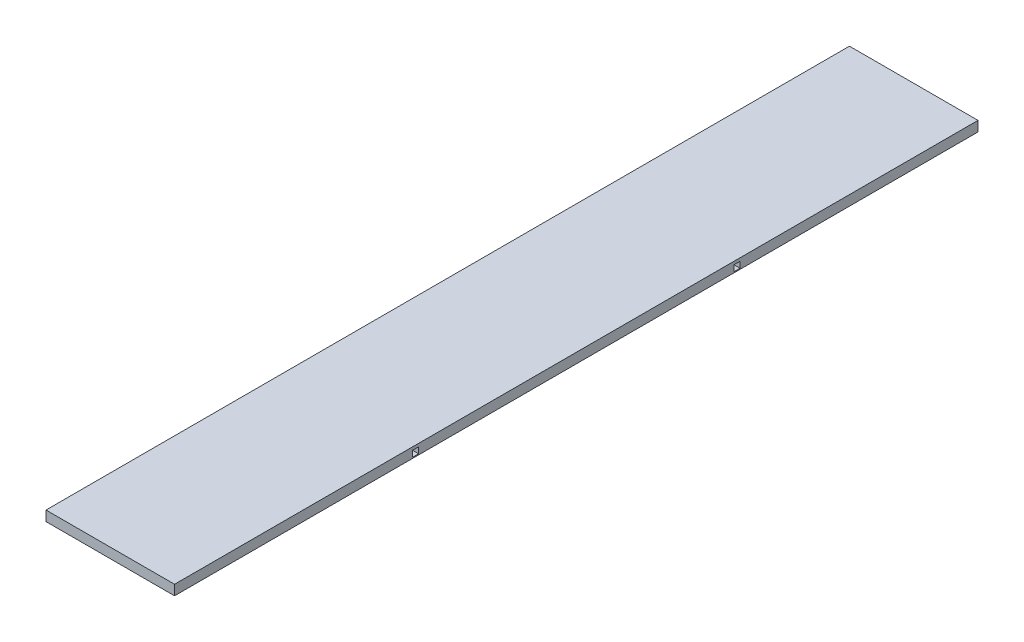
ISO-10303-21;
HEADER;
FILE_DESCRIPTION(('STEP AP214'),'2;1');
FILE_NAME('part.step','',(''),(''),'','','');
FILE_SCHEMA(('AUTOMOTIVE_DESIGN { 1 0 10303 214 1 1 1 1 }'));
ENDSEC;
DATA;
#1=APPLICATION_CONTEXT('core data for automotive mechanical design processes');
#2=APPLICATION_PROTOCOL_DEFINITION('international standard','automotive_design',2000,#1);
#3=PRODUCT_CONTEXT('',#1,'mechanical');
#4=PRODUCT('Part','Part','',(#3));
#5=PRODUCT_RELATED_PRODUCT_CATEGORY('part','',(#4));
#6=PRODUCT_DEFINITION_FORMATION('','',#4);
#7=PRODUCT_DEFINITION_CONTEXT('part definition',#1,'design');
#8=PRODUCT_DEFINITION('design','',#6,#7);
#9=PRODUCT_DEFINITION_SHAPE('','',#8);
#10=(LENGTH_UNIT() NAMED_UNIT(*) SI_UNIT(.MILLI.,.METRE.));
#11=(NAMED_UNIT(*) PLANE_ANGLE_UNIT() SI_UNIT($,.RADIAN.));
#12=(NAMED_UNIT(*) SI_UNIT($,.STERADIAN.) SOLID_ANGLE_UNIT());
#13=UNCERTAINTY_MEASURE_WITH_UNIT(LENGTH_MEASURE(1.E-05),#10,'distance_accuracy_value','');
#14=(GEOMETRIC_REPRESENTATION_CONTEXT(3) GLOBAL_UNCERTAINTY_ASSIGNED_CONTEXT((#13)) GLOBAL_UNIT_ASSIGNED_CONTEXT((#10,
#11,#12)) REPRESENTATION_CONTEXT('',''));
#15=CARTESIAN_POINT('',(0.,0.,0.));
#16=DIRECTION('',(0.,0.,1.));
#17=DIRECTION('',(1.,0.,0.));
#18=AXIS2_PLACEMENT_3D('',#15,#16,#17);
#19=CARTESIAN_POINT('',(203.2,31.75,-1270.));
#20=DIRECTION('',(-1.,0.,0.));
#21=DIRECTION('',(0.,0.,1.));
#22=AXIS2_PLACEMENT_3D('',#19,#20,#21);
#23=PLANE('',#22);
#24=DIRECTION('',(0.,0.,1.));
#25=VECTOR('',#24,1.);
#26=CARTESIAN_POINT('',(203.2,22.225,517.525));
#27=LINE('',#26,#25);
#28=CARTESIAN_POINT('',(203.2,22.225,498.475));
#29=VERTEX_POINT('',#28);
#30=CARTESIAN_POINT('',(203.2,22.225,517.525));
#31=VERTEX_POINT('',#30);
#32=EDGE_CURVE('E143',#29,#31,#27,.T.);
#33=ORIENTED_EDGE('',*,*,#32,.F.);
#34=DIRECTION('',(0.,1.,0.));
#35=VECTOR('',#34,1.);
#36=CARTESIAN_POINT('',(203.2,22.225,498.475));
#37=LINE('',#36,#35);
#38=CARTESIAN_POINT('',(203.2,3.175,498.475));
#39=VERTEX_POINT('',#38);
#40=EDGE_CURVE('E52',#39,#29,#37,.T.);
#41=ORIENTED_EDGE('',*,*,#40,.F.);
#42=DIRECTION('',(0.,0.,-1.));
#43=VECTOR('',#42,1.);
#44=CARTESIAN_POINT('',(203.2,3.175,517.525));
#45=LINE('',#44,#43);
#46=CARTESIAN_POINT('',(203.2,3.175,517.525));
#47=VERTEX_POINT('',#46);
#48=EDGE_CURVE('E149',#47,#39,#45,.T.);
#49=ORIENTED_EDGE('',*,*,#48,.F.);
#50=DIRECTION('',(0.,-1.,0.));
#51=VECTOR('',#50,1.);
#52=CARTESIAN_POINT('',(203.2,22.225,517.525));
#53=LINE('',#52,#51);
#54=EDGE_CURVE('E133',#31,#47,#53,.T.);
#55=ORIENTED_EDGE('',*,*,#54,.F.);
#56=EDGE_LOOP('',(#33,#41,#49,#55));
#57=FACE_BOUND('',#56,.T.);
#58=DIRECTION('',(0.,0.,1.));
#59=VECTOR('',#58,1.);
#60=CARTESIAN_POINT('',(203.2,22.225,-498.475));
#61=LINE('',#60,#59);
#62=CARTESIAN_POINT('',(203.2,22.225,-517.525));
#63=VERTEX_POINT('',#62);
#64=CARTESIAN_POINT('',(203.2,22.225,-498.475));
#65=VERTEX_POINT('',#64);
#66=EDGE_CURVE('E172',#63,#65,#61,.T.);
#67=ORIENTED_EDGE('',*,*,#66,.F.);
#68=DIRECTION('',(0.,1.,0.));
#69=VECTOR('',#68,1.);
#70=CARTESIAN_POINT('',(203.2,22.225,-517.525));
#71=LINE('',#70,#69);
#72=CARTESIAN_POINT('',(203.2,3.175,-517.525));
#73=VERTEX_POINT('',#72);
#74=EDGE_CURVE('E60',#73,#63,#71,.T.);
#75=ORIENTED_EDGE('',*,*,#74,.F.);
#76=DIRECTION('',(0.,0.,-1.));
#77=VECTOR('',#76,1.);
#78=CARTESIAN_POINT('',(203.2,3.175,-498.475));
#79=LINE('',#78,#77);
#80=CARTESIAN_POINT('',(203.2,3.175,-498.475));
#81=VERTEX_POINT('',#80);
#82=EDGE_CURVE('E178',#81,#73,#79,.T.);
#83=ORIENTED_EDGE('',*,*,#82,.F.);
#84=DIRECTION('',(0.,-1.,0.));
#85=VECTOR('',#84,1.);
#86=CARTESIAN_POINT('',(203.2,22.225,-498.475));
#87=LINE('',#86,#85);
#88=EDGE_CURVE('E175',#65,#81,#87,.T.);
#89=ORIENTED_EDGE('',*,*,#88,.F.);
#90=EDGE_LOOP('',(#67,#75,#83,#89));
#91=FACE_BOUND('',#90,.T.);
#92=DIRECTION('',(0.,0.,-1.));
#93=VECTOR('',#92,1.);
#94=CARTESIAN_POINT('',(203.2,0.,-1270.));
#95=LINE('',#94,#93);
#96=CARTESIAN_POINT('',(203.2,0.,1270.));
#97=VERTEX_POINT('',#96);
#98=CARTESIAN_POINT('',(203.2,0.,-1270.));
#99=VERTEX_POINT('',#98);
#100=EDGE_CURVE('E160',#97,#99,#95,.T.);
#101=ORIENTED_EDGE('',*,*,#100,.T.);
#102=DIRECTION('',(0.,-1.,0.));
#103=VECTOR('',#102,1.);
#104=CARTESIAN_POINT('',(203.2,31.75,-1270.));
#105=LINE('',#104,#103);
#106=CARTESIAN_POINT('',(203.2,31.75,-1270.));
#107=VERTEX_POINT('',#106);
#108=EDGE_CURVE('E11',#107,#99,#105,.T.);
#109=ORIENTED_EDGE('',*,*,#108,.F.);
#110=DIRECTION('',(0.,0.,-1.));
#111=VECTOR('',#110,1.);
#112=CARTESIAN_POINT('',(203.2,31.75,-1270.));
#113=LINE('',#112,#111);
#114=CARTESIAN_POINT('',(203.2,31.75,1270.));
#115=VERTEX_POINT('',#114);
#116=EDGE_CURVE('E189',#115,#107,#113,.T.);
#117=ORIENTED_EDGE('',*,*,#116,.F.);
#118=DIRECTION('',(0.,-1.,0.));
#119=VECTOR('',#118,1.);
#120=CARTESIAN_POINT('',(203.2,31.75,1270.));
#121=LINE('',#120,#119);
#122=EDGE_CURVE('E199',#115,#97,#121,.T.);
#123=ORIENTED_EDGE('',*,*,#122,.T.);
#124=EDGE_LOOP('',(#101,#109,#117,#123));
#125=FACE_BOUND('',#124,.T.);
#126=ADVANCED_FACE('F38',(#57,#91,#125),#23,.F.);
#127=CARTESIAN_POINT('',(-203.2,31.75,-1270.));
#128=DIRECTION('',(0.,0.,1.));
#129=DIRECTION('',(1.,0.,0.));
#130=AXIS2_PLACEMENT_3D('',#127,#128,#129);
#131=PLANE('',#130);
#132=DIRECTION('',(-1.,0.,0.));
#133=VECTOR('',#132,1.);
#134=CARTESIAN_POINT('',(-203.2,0.,-1270.));
#135=LINE('',#134,#133);
#136=CARTESIAN_POINT('',(-203.2,0.,-1270.));
#137=VERTEX_POINT('',#136);
#138=EDGE_CURVE('E202',#99,#137,#135,.T.);
#139=ORIENTED_EDGE('',*,*,#138,.T.);
#140=DIRECTION('',(0.,-1.,0.));
#141=VECTOR('',#140,1.);
#142=CARTESIAN_POINT('',(-203.2,31.75,-1270.));
#143=LINE('',#142,#141);
#144=CARTESIAN_POINT('',(-203.2,31.75,-1270.));
#145=VERTEX_POINT('',#144);
#146=EDGE_CURVE('E45',#145,#137,#143,.T.);
#147=ORIENTED_EDGE('',*,*,#146,.F.);
#148=DIRECTION('',(-1.,0.,0.));
#149=VECTOR('',#148,1.);
#150=CARTESIAN_POINT('',(-203.2,31.75,-1270.));
#151=LINE('',#150,#149);
#152=EDGE_CURVE('E192',#107,#145,#151,.T.);
#153=ORIENTED_EDGE('',*,*,#152,.F.);
#154=ORIENTED_EDGE('',*,*,#108,.T.);
#155=EDGE_LOOP('',(#139,#147,#153,#154));
#156=FACE_BOUND('',#155,.T.);
#157=ADVANCED_FACE('F232',(#156),#131,.F.);
#158=CARTESIAN_POINT('',(-203.2,31.75,-1270.));
#159=DIRECTION('',(1.,0.,0.));
#160=DIRECTION('',(0.,0.,-1.));
#161=AXIS2_PLACEMENT_3D('',#158,#159,#160);
#162=PLANE('',#161);
#163=DIRECTION('',(0.,0.,1.));
#164=VECTOR('',#163,1.);
#165=CARTESIAN_POINT('',(-203.2,3.175,517.525));
#166=LINE('',#165,#164);
#167=CARTESIAN_POINT('',(-203.2,3.175,498.475));
#168=VERTEX_POINT('',#167);
#169=CARTESIAN_POINT('',(-203.2,3.175,517.525));
#170=VERTEX_POINT('',#169);
#171=EDGE_CURVE('E276',#168,#170,#166,.T.);
#172=ORIENTED_EDGE('',*,*,#171,.F.);
#173=DIRECTION('',(0.,-1.,0.));
#174=VECTOR('',#173,1.);
#175=CARTESIAN_POINT('',(-203.2,22.225,498.475));
#176=LINE('',#175,#174);
#177=CARTESIAN_POINT('',(-203.2,22.225,498.475));
#178=VERTEX_POINT('',#177);
#179=EDGE_CURVE('E161',#178,#168,#176,.T.);
#180=ORIENTED_EDGE('',*,*,#179,.F.);
#181=DIRECTION('',(0.,0.,-1.));
#182=VECTOR('',#181,1.);
#183=CARTESIAN_POINT('',(-203.2,22.225,517.525));
#184=LINE('',#183,#182);
#185=CARTESIAN_POINT('',(-203.2,22.225,517.525));
#186=VERTEX_POINT('',#185);
#187=EDGE_CURVE('E158',#186,#178,#184,.T.);
#188=ORIENTED_EDGE('',*,*,#187,.F.);
#189=DIRECTION('',(0.,1.,0.));
#190=VECTOR('',#189,1.);
#191=CARTESIAN_POINT('',(-203.2,22.225,517.525));
#192=LINE('',#191,#190);
#193=EDGE_CURVE('E136',#170,#186,#192,.T.);
#194=ORIENTED_EDGE('',*,*,#193,.F.);
#195=EDGE_LOOP('',(#172,#180,#188,#194));
#196=FACE_BOUND('',#195,.T.);
#197=DIRECTION('',(0.,0.,1.));
#198=VECTOR('',#197,1.);
#199=CARTESIAN_POINT('',(-203.2,3.175,-498.475));
#200=LINE('',#199,#198);
#201=CARTESIAN_POINT('',(-203.2,3.175,-517.525));
#202=VERTEX_POINT('',#201);
#203=CARTESIAN_POINT('',(-203.2,3.175,-498.475));
#204=VERTEX_POINT('',#203);
#205=EDGE_CURVE('E165',#202,#204,#200,.T.);
#206=ORIENTED_EDGE('',*,*,#205,.F.);
#207=DIRECTION('',(0.,-1.,0.));
#208=VECTOR('',#207,1.);
#209=CARTESIAN_POINT('',(-203.2,22.225,-517.525));
#210=LINE('',#209,#208);
#211=CARTESIAN_POINT('',(-203.2,22.225,-517.525));
#212=VERTEX_POINT('',#211);
#213=EDGE_CURVE('E168',#212,#202,#210,.T.);
#214=ORIENTED_EDGE('',*,*,#213,.F.);
#215=DIRECTION('',(0.,0.,-1.));
#216=VECTOR('',#215,1.);
#217=CARTESIAN_POINT('',(-203.2,22.225,-498.475));
#218=LINE('',#217,#216);
#219=CARTESIAN_POINT('',(-203.2,22.225,-498.475));
#220=VERTEX_POINT('',#219);
#221=EDGE_CURVE('E170',#220,#212,#218,.T.);
#222=ORIENTED_EDGE('',*,*,#221,.F.);
#223=DIRECTION('',(0.,1.,0.));
#224=VECTOR('',#223,1.);
#225=CARTESIAN_POINT('',(-203.2,22.225,-498.475));
#226=LINE('',#225,#224);
#227=EDGE_CURVE('E162',#204,#220,#226,.T.);
#228=ORIENTED_EDGE('',*,*,#227,.F.);
#229=EDGE_LOOP('',(#206,#214,#222,#228));
#230=FACE_BOUND('',#229,.T.);
#231=DIRECTION('',(0.,0.,1.));
#232=VECTOR('',#231,1.);
#233=CARTESIAN_POINT('',(-203.2,0.,-1270.));
#234=LINE('',#233,#232);
#235=CARTESIAN_POINT('',(-203.2,0.,1270.));
#236=VERTEX_POINT('',#235);
#237=EDGE_CURVE('E204',#137,#236,#234,.T.);
#238=ORIENTED_EDGE('',*,*,#237,.T.);
#239=DIRECTION('',(0.,-1.,0.));
#240=VECTOR('',#239,1.);
#241=CARTESIAN_POINT('',(-203.2,31.75,1270.));
#242=LINE('',#241,#240);
#243=CARTESIAN_POINT('',(-203.2,31.75,1270.));
#244=VERTEX_POINT('',#243);
#245=EDGE_CURVE('E209',#244,#236,#242,.T.);
#246=ORIENTED_EDGE('',*,*,#245,.F.);
#247=DIRECTION('',(0.,0.,1.));
#248=VECTOR('',#247,1.);
#249=CARTESIAN_POINT('',(-203.2,31.75,-1270.));
#250=LINE('',#249,#248);
#251=EDGE_CURVE('E195',#145,#244,#250,.T.);
#252=ORIENTED_EDGE('',*,*,#251,.F.);
#253=ORIENTED_EDGE('',*,*,#146,.T.);
#254=EDGE_LOOP('',(#238,#246,#252,#253));
#255=FACE_BOUND('',#254,.T.);
#256=ADVANCED_FACE('F216',(#196,#230,#255),#162,.F.);
#257=CARTESIAN_POINT('',(-203.2,31.75,1270.));
#258=DIRECTION('',(0.,0.,-1.));
#259=DIRECTION('',(-1.,0.,0.));
#260=AXIS2_PLACEMENT_3D('',#257,#258,#259);
#261=PLANE('',#260);
#262=DIRECTION('',(1.,0.,0.));
#263=VECTOR('',#262,1.);
#264=CARTESIAN_POINT('',(-203.2,0.,1270.));
#265=LINE('',#264,#263);
#266=EDGE_CURVE('E193',#236,#97,#265,.T.);
#267=ORIENTED_EDGE('',*,*,#266,.T.);
#268=ORIENTED_EDGE('',*,*,#122,.F.);
#269=DIRECTION('',(1.,0.,0.));
#270=VECTOR('',#269,1.);
#271=CARTESIAN_POINT('',(-203.2,31.75,1270.));
#272=LINE('',#271,#270);
#273=EDGE_CURVE('E197',#244,#115,#272,.T.);
#274=ORIENTED_EDGE('',*,*,#273,.F.);
#275=ORIENTED_EDGE('',*,*,#245,.T.);
#276=EDGE_LOOP('',(#267,#268,#274,#275));
#277=FACE_BOUND('',#276,.T.);
#278=ADVANCED_FACE('F225',(#277),#261,.F.);
#279=CARTESIAN_POINT('',(0.,31.75,0.));
#280=DIRECTION('',(0.,1.,0.));
#281=DIRECTION('',(0.,0.,1.));
#282=AXIS2_PLACEMENT_3D('',#279,#280,#281);
#283=PLANE('',#282);
#284=ORIENTED_EDGE('',*,*,#116,.T.);
#285=ORIENTED_EDGE('',*,*,#152,.T.);
#286=ORIENTED_EDGE('',*,*,#251,.T.);
#287=ORIENTED_EDGE('',*,*,#273,.T.);
#288=EDGE_LOOP('',(#284,#285,#286,#287));
#289=FACE_BOUND('',#288,.T.);
#290=ADVANCED_FACE('F231',(#289),#283,.T.);
#291=CARTESIAN_POINT('',(0.,0.,0.));
#292=DIRECTION('',(0.,1.,0.));
#293=DIRECTION('',(0.,0.,1.));
#294=AXIS2_PLACEMENT_3D('',#291,#292,#293);
#295=PLANE('',#294);
#296=ORIENTED_EDGE('',*,*,#100,.F.);
#297=ORIENTED_EDGE('',*,*,#266,.F.);
#298=ORIENTED_EDGE('',*,*,#237,.F.);
#299=ORIENTED_EDGE('',*,*,#138,.F.);
#300=EDGE_LOOP('',(#296,#297,#298,#299));
#301=FACE_BOUND('',#300,.T.);
#302=ADVANCED_FACE('F222',(#301),#295,.F.);
#303=CARTESIAN_POINT('',(-230.140768363208,22.225,-517.525));
#304=DIRECTION('',(0.,0.,-1.));
#305=DIRECTION('',(-1.,0.,0.));
#306=AXIS2_PLACEMENT_3D('',#303,#304,#305);
#307=PLANE('',#306);
#308=ORIENTED_EDGE('',*,*,#213,.T.);
#309=DIRECTION('',(1.,0.,0.));
#310=VECTOR('',#309,1.);
#311=CARTESIAN_POINT('',(-230.140768363208,3.175,-517.525));
#312=LINE('',#311,#310);
#313=EDGE_CURVE('E166',#202,#73,#312,.T.);
#314=ORIENTED_EDGE('',*,*,#313,.T.);
#315=ORIENTED_EDGE('',*,*,#74,.T.);
#316=DIRECTION('',(1.,0.,0.));
#317=VECTOR('',#316,1.);
#318=CARTESIAN_POINT('',(-230.140768363208,22.225,-517.525));
#319=LINE('',#318,#317);
#320=EDGE_CURVE('E181',#212,#63,#319,.T.);
#321=ORIENTED_EDGE('',*,*,#320,.F.);
#322=EDGE_LOOP('',(#308,#314,#315,#321));
#323=FACE_BOUND('',#322,.T.);
#324=ADVANCED_FACE('F245',(#323),#307,.F.);
#325=CARTESIAN_POINT('',(-230.140768363208,3.175,-498.475));
#326=DIRECTION('',(0.,-1.,0.));
#327=DIRECTION('',(0.,0.,-1.));
#328=AXIS2_PLACEMENT_3D('',#325,#326,#327);
#329=PLANE('',#328);
#330=ORIENTED_EDGE('',*,*,#205,.T.);
#331=DIRECTION('',(1.,0.,0.));
#332=VECTOR('',#331,1.);
#333=CARTESIAN_POINT('',(-230.140768363208,3.175,-498.475));
#334=LINE('',#333,#332);
#335=EDGE_CURVE('E183',#204,#81,#334,.T.);
#336=ORIENTED_EDGE('',*,*,#335,.T.);
#337=ORIENTED_EDGE('',*,*,#82,.T.);
#338=ORIENTED_EDGE('',*,*,#313,.F.);
#339=EDGE_LOOP('',(#330,#336,#337,#338));
#340=FACE_BOUND('',#339,.T.);
#341=ADVANCED_FACE('F250',(#340),#329,.F.);
#342=CARTESIAN_POINT('',(-230.140768363208,22.225,-498.475));
#343=DIRECTION('',(0.,0.,1.));
#344=DIRECTION('',(1.,0.,0.));
#345=AXIS2_PLACEMENT_3D('',#342,#343,#344);
#346=PLANE('',#345);
#347=ORIENTED_EDGE('',*,*,#227,.T.);
#348=DIRECTION('',(1.,0.,0.));
#349=VECTOR('',#348,1.);
#350=CARTESIAN_POINT('',(-230.140768363208,22.225,-498.475));
#351=LINE('',#350,#349);
#352=EDGE_CURVE('E185',#220,#65,#351,.T.);
#353=ORIENTED_EDGE('',*,*,#352,.T.);
#354=ORIENTED_EDGE('',*,*,#88,.T.);
#355=ORIENTED_EDGE('',*,*,#335,.F.);
#356=EDGE_LOOP('',(#347,#353,#354,#355));
#357=FACE_BOUND('',#356,.T.);
#358=ADVANCED_FACE('F255',(#357),#346,.F.);
#359=CARTESIAN_POINT('',(-230.140768363208,22.225,-498.475));
#360=DIRECTION('',(0.,1.,0.));
#361=DIRECTION('',(0.,0.,1.));
#362=AXIS2_PLACEMENT_3D('',#359,#360,#361);
#363=PLANE('',#362);
#364=ORIENTED_EDGE('',*,*,#221,.T.);
#365=ORIENTED_EDGE('',*,*,#320,.T.);
#366=ORIENTED_EDGE('',*,*,#66,.T.);
#367=ORIENTED_EDGE('',*,*,#352,.F.);
#368=EDGE_LOOP('',(#364,#365,#366,#367));
#369=FACE_BOUND('',#368,.T.);
#370=ADVANCED_FACE('F251',(#369),#363,.F.);
#371=CARTESIAN_POINT('',(-230.140768363207,22.225,498.475));
#372=DIRECTION('',(0.,0.,-1.));
#373=DIRECTION('',(-1.,0.,0.));
#374=AXIS2_PLACEMENT_3D('',#371,#372,#373);
#375=PLANE('',#374);
#376=ORIENTED_EDGE('',*,*,#179,.T.);
#377=DIRECTION('',(1.,0.,0.));
#378=VECTOR('',#377,1.);
#379=CARTESIAN_POINT('',(-230.140768363207,3.175,498.475));
#380=LINE('',#379,#378);
#381=EDGE_CURVE('E154',#168,#39,#380,.T.);
#382=ORIENTED_EDGE('',*,*,#381,.T.);
#383=ORIENTED_EDGE('',*,*,#40,.T.);
#384=DIRECTION('',(1.,0.,0.));
#385=VECTOR('',#384,1.);
#386=CARTESIAN_POINT('',(-230.140768363207,22.225,498.475));
#387=LINE('',#386,#385);
#388=EDGE_CURVE('E140',#178,#29,#387,.T.);
#389=ORIENTED_EDGE('',*,*,#388,.F.);
#390=EDGE_LOOP('',(#376,#382,#383,#389));
#391=FACE_BOUND('',#390,.T.);
#392=ADVANCED_FACE('F254',(#391),#375,.F.);
#393=CARTESIAN_POINT('',(-230.140768363207,3.175,517.525));
#394=DIRECTION('',(0.,-1.,0.));
#395=DIRECTION('',(0.,0.,-1.));
#396=AXIS2_PLACEMENT_3D('',#393,#394,#395);
#397=PLANE('',#396);
#398=ORIENTED_EDGE('',*,*,#171,.T.);
#399=DIRECTION('',(1.,0.,0.));
#400=VECTOR('',#399,1.);
#401=CARTESIAN_POINT('',(-230.140768363207,3.175,517.525));
#402=LINE('',#401,#400);
#403=EDGE_CURVE('E139',#170,#47,#402,.T.);
#404=ORIENTED_EDGE('',*,*,#403,.T.);
#405=ORIENTED_EDGE('',*,*,#48,.T.);
#406=ORIENTED_EDGE('',*,*,#381,.F.);
#407=EDGE_LOOP('',(#398,#404,#405,#406));
#408=FACE_BOUND('',#407,.T.);
#409=ADVANCED_FACE('F265',(#408),#397,.F.);
#410=CARTESIAN_POINT('',(-230.140768363207,22.225,517.525));
#411=DIRECTION('',(0.,0.,1.));
#412=DIRECTION('',(1.,0.,0.));
#413=AXIS2_PLACEMENT_3D('',#410,#411,#412);
#414=PLANE('',#413);
#415=ORIENTED_EDGE('',*,*,#193,.T.);
#416=DIRECTION('',(1.,0.,0.));
#417=VECTOR('',#416,1.);
#418=CARTESIAN_POINT('',(-230.140768363207,22.225,517.525));
#419=LINE('',#418,#417);
#420=EDGE_CURVE('E128',#186,#31,#419,.T.);
#421=ORIENTED_EDGE('',*,*,#420,.T.);
#422=ORIENTED_EDGE('',*,*,#54,.T.);
#423=ORIENTED_EDGE('',*,*,#403,.F.);
#424=EDGE_LOOP('',(#415,#421,#422,#423));
#425=FACE_BOUND('',#424,.T.);
#426=ADVANCED_FACE('F130',(#425),#414,.F.);
#427=CARTESIAN_POINT('',(-230.140768363207,22.225,517.525));
#428=DIRECTION('',(0.,1.,0.));
#429=DIRECTION('',(0.,0.,1.));
#430=AXIS2_PLACEMENT_3D('',#427,#428,#429);
#431=PLANE('',#430);
#432=ORIENTED_EDGE('',*,*,#187,.T.);
#433=ORIENTED_EDGE('',*,*,#388,.T.);
#434=ORIENTED_EDGE('',*,*,#32,.T.);
#435=ORIENTED_EDGE('',*,*,#420,.F.);
#436=EDGE_LOOP('',(#432,#433,#434,#435));
#437=FACE_BOUND('',#436,.T.);
#438=ADVANCED_FACE('F144',(#437),#431,.F.);
#439=CLOSED_SHELL('',(#126,#157,#256,#278,#290,#302,#324,#341,#358,#370,#392,#409,#426,#438));
#440=MANIFOLD_SOLID_BREP('B2',#439);
#441=ADVANCED_BREP_SHAPE_REPRESENTATION('',(#18,#440),#14);
#442=SHAPE_DEFINITION_REPRESENTATION(#9,#441);
ENDSEC;
END-ISO-10303-21;
